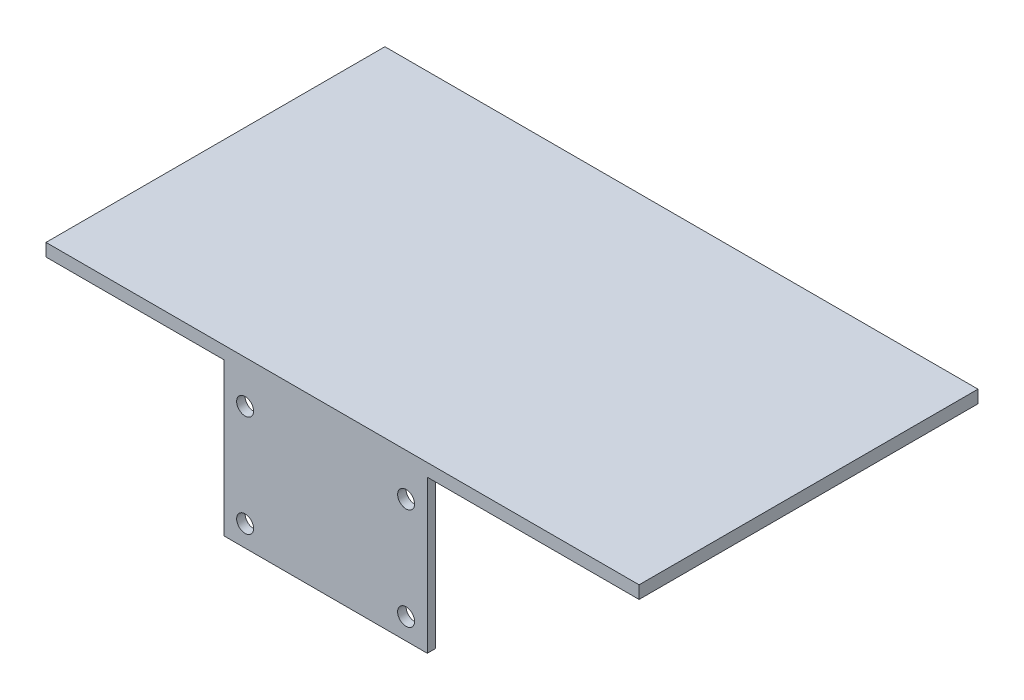
ISO-10303-21;
HEADER;
FILE_DESCRIPTION(('STEP AP214'),'2;1');
FILE_NAME('part.step','',(''),(''),'','','');
FILE_SCHEMA(('AUTOMOTIVE_DESIGN { 1 0 10303 214 1 1 1 1 }'));
ENDSEC;
DATA;
#1=APPLICATION_CONTEXT('core data for automotive mechanical design processes');
#2=APPLICATION_PROTOCOL_DEFINITION('international standard','automotive_design',2000,#1);
#3=PRODUCT_CONTEXT('',#1,'mechanical');
#4=PRODUCT('Part','Part','',(#3));
#5=PRODUCT_RELATED_PRODUCT_CATEGORY('part','',(#4));
#6=PRODUCT_DEFINITION_FORMATION('','',#4);
#7=PRODUCT_DEFINITION_CONTEXT('part definition',#1,'design');
#8=PRODUCT_DEFINITION('design','',#6,#7);
#9=PRODUCT_DEFINITION_SHAPE('','',#8);
#10=(LENGTH_UNIT() NAMED_UNIT(*) SI_UNIT(.MILLI.,.METRE.));
#11=(NAMED_UNIT(*) PLANE_ANGLE_UNIT() SI_UNIT($,.RADIAN.));
#12=(NAMED_UNIT(*) SI_UNIT($,.STERADIAN.) SOLID_ANGLE_UNIT());
#13=UNCERTAINTY_MEASURE_WITH_UNIT(LENGTH_MEASURE(1.E-05),#10,'distance_accuracy_value','');
#14=(GEOMETRIC_REPRESENTATION_CONTEXT(3) GLOBAL_UNCERTAINTY_ASSIGNED_CONTEXT((#13)) GLOBAL_UNIT_ASSIGNED_CONTEXT((#10,
#11,#12)) REPRESENTATION_CONTEXT('',''));
#15=CARTESIAN_POINT('',(0.,0.,0.));
#16=DIRECTION('',(0.,0.,1.));
#17=DIRECTION('',(1.,0.,0.));
#18=AXIS2_PLACEMENT_3D('',#15,#16,#17);
#19=CARTESIAN_POINT('',(0.,0.,2.));
#20=DIRECTION('',(0.,0.,1.));
#21=DIRECTION('',(1.,0.,0.));
#22=AXIS2_PLACEMENT_3D('',#19,#20,#21);
#23=PLANE('',#22);
#24=CARTESIAN_POINT('',(19.,-13.,2.));
#25=DIRECTION('',(0.,0.,1.));
#26=DIRECTION('',(-1.,0.,0.));
#27=AXIS2_PLACEMENT_3D('',#24,#25,#26);
#28=CIRCLE('',#27,2.);
#29=CARTESIAN_POINT('',(17.,-13.,2.));
#30=VERTEX_POINT('',#29);
#31=EDGE_CURVE('E156',#30,#30,#28,.T.);
#32=ORIENTED_EDGE('',*,*,#31,.F.);
#33=EDGE_LOOP('',(#32));
#34=FACE_BOUND('',#33,.T.);
#35=CARTESIAN_POINT('',(-19.,11.,2.));
#36=DIRECTION('',(0.,0.,1.));
#37=DIRECTION('',(1.,0.,0.));
#38=AXIS2_PLACEMENT_3D('',#35,#36,#37);
#39=CIRCLE('',#38,2.);
#40=CARTESIAN_POINT('',(-17.,11.,2.));
#41=VERTEX_POINT('',#40);
#42=EDGE_CURVE('E172',#41,#41,#39,.T.);
#43=ORIENTED_EDGE('',*,*,#42,.F.);
#44=EDGE_LOOP('',(#43));
#45=FACE_BOUND('',#44,.T.);
#46=DIRECTION('',(0.,1.,0.));
#47=VECTOR('',#46,1.);
#48=CARTESIAN_POINT('',(24.,18.,2.));
#49=LINE('',#48,#47);
#50=CARTESIAN_POINT('',(24.,-18.,2.));
#51=VERTEX_POINT('',#50);
#52=CARTESIAN_POINT('',(24.,18.,2.));
#53=VERTEX_POINT('',#52);
#54=EDGE_CURVE('E82',#51,#53,#49,.T.);
#55=ORIENTED_EDGE('',*,*,#54,.T.);
#56=DIRECTION('',(1.,0.,0.));
#57=VECTOR('',#56,1.);
#58=CARTESIAN_POINT('',(-66.,18.,2.));
#59=LINE('',#58,#57);
#60=CARTESIAN_POINT('',(74.,18.,2.));
#61=VERTEX_POINT('',#60);
#62=EDGE_CURVE('E215',#53,#61,#59,.T.);
#63=ORIENTED_EDGE('',*,*,#62,.T.);
#64=DIRECTION('',(0.,-1.,0.));
#65=VECTOR('',#64,1.);
#66=CARTESIAN_POINT('',(74.,21.,2.));
#67=LINE('',#66,#65);
#68=CARTESIAN_POINT('',(74.,21.,2.));
#69=VERTEX_POINT('',#68);
#70=EDGE_CURVE('E353',#69,#61,#67,.T.);
#71=ORIENTED_EDGE('',*,*,#70,.F.);
#72=DIRECTION('',(1.,0.,0.));
#73=VECTOR('',#72,1.);
#74=CARTESIAN_POINT('',(-66.,21.,2.));
#75=LINE('',#74,#73);
#76=CARTESIAN_POINT('',(-66.,21.,2.));
#77=VERTEX_POINT('',#76);
#78=EDGE_CURVE('E130',#77,#69,#75,.T.);
#79=ORIENTED_EDGE('',*,*,#78,.F.);
#80=DIRECTION('',(0.,-1.,0.));
#81=VECTOR('',#80,1.);
#82=CARTESIAN_POINT('',(-66.,21.,2.));
#83=LINE('',#82,#81);
#84=CARTESIAN_POINT('',(-66.,18.,2.));
#85=VERTEX_POINT('',#84);
#86=EDGE_CURVE('E148',#77,#85,#83,.T.);
#87=ORIENTED_EDGE('',*,*,#86,.T.);
#88=CARTESIAN_POINT('',(-24.,18.,2.));
#89=VERTEX_POINT('',#88);
#90=EDGE_CURVE('E135',#85,#89,#59,.T.);
#91=ORIENTED_EDGE('',*,*,#90,.T.);
#92=DIRECTION('',(0.,-1.,0.));
#93=VECTOR('',#92,1.);
#94=CARTESIAN_POINT('',(-24.,18.,2.));
#95=LINE('',#94,#93);
#96=CARTESIAN_POINT('',(-24.,-18.,2.));
#97=VERTEX_POINT('',#96);
#98=EDGE_CURVE('E182',#89,#97,#95,.T.);
#99=ORIENTED_EDGE('',*,*,#98,.T.);
#100=DIRECTION('',(1.,0.,0.));
#101=VECTOR('',#100,1.);
#102=CARTESIAN_POINT('',(-24.,-18.,2.));
#103=LINE('',#102,#101);
#104=EDGE_CURVE('E57',#97,#51,#103,.T.);
#105=ORIENTED_EDGE('',*,*,#104,.T.);
#106=EDGE_LOOP('',(#55,#63,#71,#79,#87,#91,#99,#105));
#107=FACE_BOUND('',#106,.T.);
#108=CARTESIAN_POINT('',(-19.,-13.,2.));
#109=DIRECTION('',(0.,0.,1.));
#110=DIRECTION('',(1.,0.,0.));
#111=AXIS2_PLACEMENT_3D('',#108,#109,#110);
#112=CIRCLE('',#111,2.);
#113=CARTESIAN_POINT('',(-17.,-13.,2.));
#114=VERTEX_POINT('',#113);
#115=EDGE_CURVE('E164',#114,#114,#112,.T.);
#116=ORIENTED_EDGE('',*,*,#115,.F.);
#117=EDGE_LOOP('',(#116));
#118=FACE_BOUND('',#117,.T.);
#119=CARTESIAN_POINT('',(19.,11.,2.));
#120=DIRECTION('',(0.,0.,1.));
#121=DIRECTION('',(-1.,0.,0.));
#122=AXIS2_PLACEMENT_3D('',#119,#120,#121);
#123=CIRCLE('',#122,2.);
#124=CARTESIAN_POINT('',(17.,11.,2.));
#125=VERTEX_POINT('',#124);
#126=EDGE_CURVE('E146',#125,#125,#123,.T.);
#127=ORIENTED_EDGE('',*,*,#126,.F.);
#128=EDGE_LOOP('',(#127));
#129=FACE_BOUND('',#128,.T.);
#130=ADVANCED_FACE('F39',(#34,#45,#107,#118,#129),#23,.T.);
#131=CARTESIAN_POINT('',(0.,0.,0.));
#132=DIRECTION('',(0.,0.,1.));
#133=DIRECTION('',(1.,0.,0.));
#134=AXIS2_PLACEMENT_3D('',#131,#132,#133);
#135=PLANE('',#134);
#136=DIRECTION('',(0.,1.,0.));
#137=VECTOR('',#136,1.);
#138=CARTESIAN_POINT('',(24.,18.,0.));
#139=LINE('',#138,#137);
#140=CARTESIAN_POINT('',(24.,-18.,0.));
#141=VERTEX_POINT('',#140);
#142=CARTESIAN_POINT('',(24.,18.,0.));
#143=VERTEX_POINT('',#142);
#144=EDGE_CURVE('E176',#141,#143,#139,.T.);
#145=ORIENTED_EDGE('',*,*,#144,.F.);
#146=DIRECTION('',(1.,0.,0.));
#147=VECTOR('',#146,1.);
#148=CARTESIAN_POINT('',(-24.,-18.,0.));
#149=LINE('',#148,#147);
#150=CARTESIAN_POINT('',(-24.,-18.,0.));
#151=VERTEX_POINT('',#150);
#152=EDGE_CURVE('E77',#151,#141,#149,.T.);
#153=ORIENTED_EDGE('',*,*,#152,.F.);
#154=DIRECTION('',(0.,-1.,0.));
#155=VECTOR('',#154,1.);
#156=CARTESIAN_POINT('',(-24.,18.,0.));
#157=LINE('',#156,#155);
#158=CARTESIAN_POINT('',(-24.,18.,0.));
#159=VERTEX_POINT('',#158);
#160=EDGE_CURVE('E71',#159,#151,#157,.T.);
#161=ORIENTED_EDGE('',*,*,#160,.F.);
#162=DIRECTION('',(-1.,0.,0.));
#163=VECTOR('',#162,1.);
#164=CARTESIAN_POINT('',(-24.,18.,0.));
#165=LINE('',#164,#163);
#166=EDGE_CURVE('E190',#143,#159,#165,.T.);
#167=ORIENTED_EDGE('',*,*,#166,.F.);
#168=EDGE_LOOP('',(#145,#153,#161,#167));
#169=FACE_BOUND('',#168,.T.);
#170=CARTESIAN_POINT('',(-19.,11.,0.));
#171=DIRECTION('',(0.,0.,1.));
#172=DIRECTION('',(1.,0.,0.));
#173=AXIS2_PLACEMENT_3D('',#170,#171,#172);
#174=CIRCLE('',#173,2.);
#175=CARTESIAN_POINT('',(-17.,11.,0.));
#176=VERTEX_POINT('',#175);
#177=EDGE_CURVE('E168',#176,#176,#174,.T.);
#178=ORIENTED_EDGE('',*,*,#177,.T.);
#179=EDGE_LOOP('',(#178));
#180=FACE_BOUND('',#179,.T.);
#181=CARTESIAN_POINT('',(-19.,-13.,0.));
#182=DIRECTION('',(0.,0.,1.));
#183=DIRECTION('',(1.,0.,0.));
#184=AXIS2_PLACEMENT_3D('',#181,#182,#183);
#185=CIRCLE('',#184,2.);
#186=CARTESIAN_POINT('',(-17.,-13.,0.));
#187=VERTEX_POINT('',#186);
#188=EDGE_CURVE('E160',#187,#187,#185,.T.);
#189=ORIENTED_EDGE('',*,*,#188,.T.);
#190=EDGE_LOOP('',(#189));
#191=FACE_BOUND('',#190,.T.);
#192=CARTESIAN_POINT('',(19.,-13.,0.));
#193=DIRECTION('',(0.,0.,1.));
#194=DIRECTION('',(-1.,0.,0.));
#195=AXIS2_PLACEMENT_3D('',#192,#193,#194);
#196=CIRCLE('',#195,2.);
#197=CARTESIAN_POINT('',(17.,-13.,0.));
#198=VERTEX_POINT('',#197);
#199=EDGE_CURVE('E154',#198,#198,#196,.T.);
#200=ORIENTED_EDGE('',*,*,#199,.T.);
#201=EDGE_LOOP('',(#200));
#202=FACE_BOUND('',#201,.T.);
#203=CARTESIAN_POINT('',(19.,11.,0.));
#204=DIRECTION('',(0.,0.,1.));
#205=DIRECTION('',(-1.,0.,0.));
#206=AXIS2_PLACEMENT_3D('',#203,#204,#205);
#207=CIRCLE('',#206,2.);
#208=CARTESIAN_POINT('',(17.,11.,0.));
#209=VERTEX_POINT('',#208);
#210=EDGE_CURVE('E141',#209,#209,#207,.T.);
#211=ORIENTED_EDGE('',*,*,#210,.T.);
#212=EDGE_LOOP('',(#211));
#213=FACE_BOUND('',#212,.T.);
#214=ADVANCED_FACE('F211',(#169,#180,#191,#202,#213),#135,.F.);
#215=CARTESIAN_POINT('',(24.,18.,2.));
#216=DIRECTION('',(-1.,0.,0.));
#217=DIRECTION('',(0.,-1.,0.));
#218=AXIS2_PLACEMENT_3D('',#215,#216,#217);
#219=PLANE('',#218);
#220=ORIENTED_EDGE('',*,*,#144,.T.);
#221=DIRECTION('',(0.,0.,-1.));
#222=VECTOR('',#221,1.);
#223=CARTESIAN_POINT('',(24.,18.,2.));
#224=LINE('',#223,#222);
#225=EDGE_CURVE('E11',#53,#143,#224,.T.);
#226=ORIENTED_EDGE('',*,*,#225,.F.);
#227=ORIENTED_EDGE('',*,*,#54,.F.);
#228=DIRECTION('',(0.,0.,-1.));
#229=VECTOR('',#228,1.);
#230=CARTESIAN_POINT('',(24.,-18.,2.));
#231=LINE('',#230,#229);
#232=EDGE_CURVE('E187',#51,#141,#231,.T.);
#233=ORIENTED_EDGE('',*,*,#232,.T.);
#234=EDGE_LOOP('',(#220,#226,#227,#233));
#235=FACE_BOUND('',#234,.T.);
#236=ADVANCED_FACE('F41',(#235),#219,.F.);
#237=CARTESIAN_POINT('',(-24.,18.,2.));
#238=DIRECTION('',(1.,0.,0.));
#239=DIRECTION('',(0.,1.,0.));
#240=AXIS2_PLACEMENT_3D('',#237,#238,#239);
#241=PLANE('',#240);
#242=ORIENTED_EDGE('',*,*,#160,.T.);
#243=DIRECTION('',(0.,0.,-1.));
#244=VECTOR('',#243,1.);
#245=CARTESIAN_POINT('',(-24.,-18.,2.));
#246=LINE('',#245,#244);
#247=EDGE_CURVE('E200',#97,#151,#246,.T.);
#248=ORIENTED_EDGE('',*,*,#247,.F.);
#249=ORIENTED_EDGE('',*,*,#98,.F.);
#250=DIRECTION('',(0.,0.,-1.));
#251=VECTOR('',#250,1.);
#252=CARTESIAN_POINT('',(-24.,18.,2.));
#253=LINE('',#252,#251);
#254=EDGE_CURVE('E49',#89,#159,#253,.T.);
#255=ORIENTED_EDGE('',*,*,#254,.T.);
#256=EDGE_LOOP('',(#242,#248,#249,#255));
#257=FACE_BOUND('',#256,.T.);
#258=ADVANCED_FACE('F204',(#257),#241,.F.);
#259=CARTESIAN_POINT('',(-24.,-18.,2.));
#260=DIRECTION('',(0.,1.,0.));
#261=DIRECTION('',(0.,0.,1.));
#262=AXIS2_PLACEMENT_3D('',#259,#260,#261);
#263=PLANE('',#262);
#264=ORIENTED_EDGE('',*,*,#152,.T.);
#265=ORIENTED_EDGE('',*,*,#232,.F.);
#266=ORIENTED_EDGE('',*,*,#104,.F.);
#267=ORIENTED_EDGE('',*,*,#247,.T.);
#268=EDGE_LOOP('',(#264,#265,#266,#267));
#269=FACE_BOUND('',#268,.T.);
#270=ADVANCED_FACE('F217',(#269),#263,.F.);
#271=CARTESIAN_POINT('',(-19.,11.,2.));
#272=DIRECTION('',(0.,0.,-1.));
#273=DIRECTION('',(-1.,0.,0.));
#274=AXIS2_PLACEMENT_3D('',#271,#272,#273);
#275=CYLINDRICAL_SURFACE('',#274,2.);
#276=ORIENTED_EDGE('',*,*,#42,.T.);
#277=EDGE_LOOP('',(#276));
#278=FACE_BOUND('',#277,.T.);
#279=ORIENTED_EDGE('',*,*,#177,.F.);
#280=EDGE_LOOP('',(#279));
#281=FACE_BOUND('',#280,.T.);
#282=ADVANCED_FACE('F219',(#278,#281),#275,.F.);
#283=CARTESIAN_POINT('',(-19.,-13.,2.));
#284=DIRECTION('',(0.,0.,-1.));
#285=DIRECTION('',(-1.,0.,0.));
#286=AXIS2_PLACEMENT_3D('',#283,#284,#285);
#287=CYLINDRICAL_SURFACE('',#286,2.);
#288=ORIENTED_EDGE('',*,*,#115,.T.);
#289=EDGE_LOOP('',(#288));
#290=FACE_BOUND('',#289,.T.);
#291=ORIENTED_EDGE('',*,*,#188,.F.);
#292=EDGE_LOOP('',(#291));
#293=FACE_BOUND('',#292,.T.);
#294=ADVANCED_FACE('F225',(#290,#293),#287,.F.);
#295=CARTESIAN_POINT('',(19.,-13.,2.));
#296=DIRECTION('',(0.,0.,-1.));
#297=DIRECTION('',(-1.,0.,0.));
#298=AXIS2_PLACEMENT_3D('',#295,#296,#297);
#299=CYLINDRICAL_SURFACE('',#298,2.);
#300=ORIENTED_EDGE('',*,*,#31,.T.);
#301=EDGE_LOOP('',(#300));
#302=FACE_BOUND('',#301,.T.);
#303=ORIENTED_EDGE('',*,*,#199,.F.);
#304=EDGE_LOOP('',(#303));
#305=FACE_BOUND('',#304,.T.);
#306=ADVANCED_FACE('F240',(#302,#305),#299,.F.);
#307=CARTESIAN_POINT('',(19.,11.,2.));
#308=DIRECTION('',(0.,0.,-1.));
#309=DIRECTION('',(-1.,0.,0.));
#310=AXIS2_PLACEMENT_3D('',#307,#308,#309);
#311=CYLINDRICAL_SURFACE('',#310,2.);
#312=ORIENTED_EDGE('',*,*,#126,.T.);
#313=EDGE_LOOP('',(#312));
#314=FACE_BOUND('',#313,.T.);
#315=ORIENTED_EDGE('',*,*,#210,.F.);
#316=EDGE_LOOP('',(#315));
#317=FACE_BOUND('',#316,.T.);
#318=ADVANCED_FACE('F244',(#314,#317),#311,.F.);
#319=CARTESIAN_POINT('',(74.,21.,-78.));
#320=DIRECTION('',(-1.,0.,0.));
#321=DIRECTION('',(0.,0.,1.));
#322=AXIS2_PLACEMENT_3D('',#319,#320,#321);
#323=PLANE('',#322);
#324=DIRECTION('',(0.,0.,-1.));
#325=VECTOR('',#324,1.);
#326=CARTESIAN_POINT('',(74.,18.,-78.));
#327=LINE('',#326,#325);
#328=CARTESIAN_POINT('',(74.,18.,-78.));
#329=VERTEX_POINT('',#328);
#330=EDGE_CURVE('E139',#61,#329,#327,.T.);
#331=ORIENTED_EDGE('',*,*,#330,.T.);
#332=DIRECTION('',(0.,-1.,0.));
#333=VECTOR('',#332,1.);
#334=CARTESIAN_POINT('',(74.,21.,-78.));
#335=LINE('',#334,#333);
#336=CARTESIAN_POINT('',(74.,21.,-78.));
#337=VERTEX_POINT('',#336);
#338=EDGE_CURVE('E117',#337,#329,#335,.T.);
#339=ORIENTED_EDGE('',*,*,#338,.F.);
#340=DIRECTION('',(0.,0.,-1.));
#341=VECTOR('',#340,1.);
#342=CARTESIAN_POINT('',(74.,21.,-78.));
#343=LINE('',#342,#341);
#344=EDGE_CURVE('E125',#69,#337,#343,.T.);
#345=ORIENTED_EDGE('',*,*,#344,.F.);
#346=ORIENTED_EDGE('',*,*,#70,.T.);
#347=EDGE_LOOP('',(#331,#339,#345,#346));
#348=FACE_BOUND('',#347,.T.);
#349=ADVANCED_FACE('F137',(#348),#323,.F.);
#350=CARTESIAN_POINT('',(-66.,21.,-78.));
#351=DIRECTION('',(0.,0.,1.));
#352=DIRECTION('',(1.,0.,0.));
#353=AXIS2_PLACEMENT_3D('',#350,#351,#352);
#354=PLANE('',#353);
#355=DIRECTION('',(-1.,0.,0.));
#356=VECTOR('',#355,1.);
#357=CARTESIAN_POINT('',(-66.,18.,-78.));
#358=LINE('',#357,#356);
#359=CARTESIAN_POINT('',(-66.,18.,-78.));
#360=VERTEX_POINT('',#359);
#361=EDGE_CURVE('E349',#329,#360,#358,.T.);
#362=ORIENTED_EDGE('',*,*,#361,.T.);
#363=DIRECTION('',(0.,-1.,0.));
#364=VECTOR('',#363,1.);
#365=CARTESIAN_POINT('',(-66.,21.,-78.));
#366=LINE('',#365,#364);
#367=CARTESIAN_POINT('',(-66.,21.,-78.));
#368=VERTEX_POINT('',#367);
#369=EDGE_CURVE('E120',#368,#360,#366,.T.);
#370=ORIENTED_EDGE('',*,*,#369,.F.);
#371=DIRECTION('',(-1.,0.,0.));
#372=VECTOR('',#371,1.);
#373=CARTESIAN_POINT('',(-66.,21.,-78.));
#374=LINE('',#373,#372);
#375=EDGE_CURVE('E113',#337,#368,#374,.T.);
#376=ORIENTED_EDGE('',*,*,#375,.F.);
#377=ORIENTED_EDGE('',*,*,#338,.T.);
#378=EDGE_LOOP('',(#362,#370,#376,#377));
#379=FACE_BOUND('',#378,.T.);
#380=ADVANCED_FACE('F115',(#379),#354,.F.);
#381=CARTESIAN_POINT('',(-66.,21.,2.));
#382=DIRECTION('',(1.,0.,0.));
#383=DIRECTION('',(0.,0.,-1.));
#384=AXIS2_PLACEMENT_3D('',#381,#382,#383);
#385=PLANE('',#384);
#386=DIRECTION('',(0.,0.,1.));
#387=VECTOR('',#386,1.);
#388=CARTESIAN_POINT('',(-66.,18.,2.));
#389=LINE('',#388,#387);
#390=EDGE_CURVE('E346',#360,#85,#389,.T.);
#391=ORIENTED_EDGE('',*,*,#390,.T.);
#392=ORIENTED_EDGE('',*,*,#86,.F.);
#393=DIRECTION('',(0.,0.,1.));
#394=VECTOR('',#393,1.);
#395=CARTESIAN_POINT('',(-66.,21.,2.));
#396=LINE('',#395,#394);
#397=EDGE_CURVE('E124',#368,#77,#396,.T.);
#398=ORIENTED_EDGE('',*,*,#397,.F.);
#399=ORIENTED_EDGE('',*,*,#369,.T.);
#400=EDGE_LOOP('',(#391,#392,#398,#399));
#401=FACE_BOUND('',#400,.T.);
#402=ADVANCED_FACE('F253',(#401),#385,.F.);
#403=CARTESIAN_POINT('',(0.,21.,0.));
#404=DIRECTION('',(0.,1.,0.));
#405=DIRECTION('',(0.,0.,1.));
#406=AXIS2_PLACEMENT_3D('',#403,#404,#405);
#407=PLANE('',#406);
#408=ORIENTED_EDGE('',*,*,#344,.T.);
#409=ORIENTED_EDGE('',*,*,#375,.T.);
#410=ORIENTED_EDGE('',*,*,#397,.T.);
#411=ORIENTED_EDGE('',*,*,#78,.T.);
#412=EDGE_LOOP('',(#408,#409,#410,#411));
#413=FACE_BOUND('',#412,.T.);
#414=ADVANCED_FACE('F128',(#413),#407,.T.);
#415=CARTESIAN_POINT('',(0.,18.,0.));
#416=DIRECTION('',(0.,1.,0.));
#417=DIRECTION('',(0.,0.,1.));
#418=AXIS2_PLACEMENT_3D('',#415,#416,#417);
#419=PLANE('',#418);
#420=ORIENTED_EDGE('',*,*,#254,.F.);
#421=ORIENTED_EDGE('',*,*,#90,.F.);
#422=ORIENTED_EDGE('',*,*,#390,.F.);
#423=ORIENTED_EDGE('',*,*,#361,.F.);
#424=ORIENTED_EDGE('',*,*,#330,.F.);
#425=ORIENTED_EDGE('',*,*,#62,.F.);
#426=ORIENTED_EDGE('',*,*,#225,.T.);
#427=ORIENTED_EDGE('',*,*,#166,.T.);
#428=EDGE_LOOP('',(#420,#421,#422,#423,#424,#425,#426,#427));
#429=FACE_BOUND('',#428,.T.);
#430=ADVANCED_FACE('F213',(#429),#419,.F.);
#431=CLOSED_SHELL('',(#130,#214,#236,#258,#270,#282,#294,#306,#318,#349,#380,#402,#414,#430));
#432=MANIFOLD_SOLID_BREP('B2',#431);
#433=ADVANCED_BREP_SHAPE_REPRESENTATION('',(#18,#432),#14);
#434=SHAPE_DEFINITION_REPRESENTATION(#9,#433);
ENDSEC;
END-ISO-10303-21;
